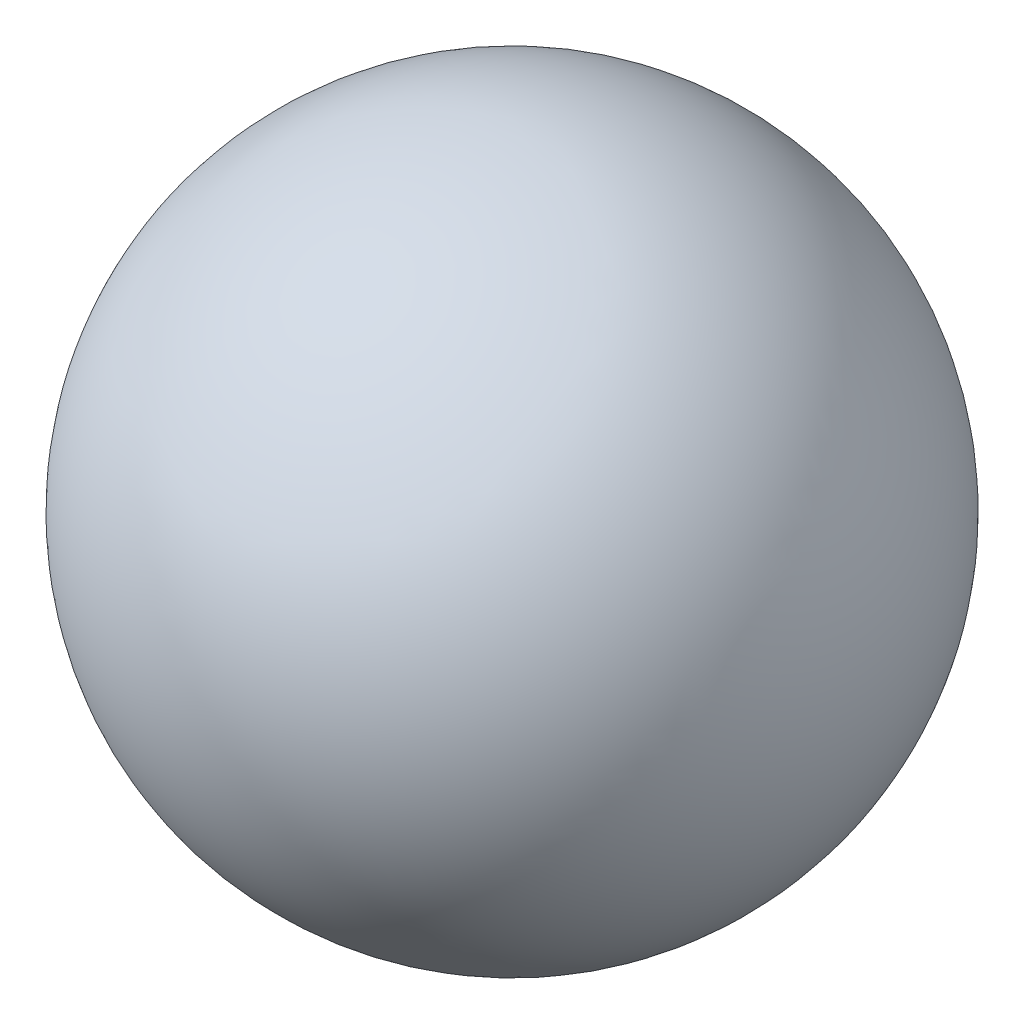
ISO-10303-21;
HEADER;
FILE_DESCRIPTION(('STEP AP214'),'2;1');
FILE_NAME('part.step','',(''),(''),'','','');
FILE_SCHEMA(('AUTOMOTIVE_DESIGN { 1 0 10303 214 1 1 1 1 }'));
ENDSEC;
DATA;
#1=APPLICATION_CONTEXT('core data for automotive mechanical design processes');
#2=APPLICATION_PROTOCOL_DEFINITION('international standard','automotive_design',2000,#1);
#3=PRODUCT_CONTEXT('',#1,'mechanical');
#4=PRODUCT('Part','Part','',(#3));
#5=PRODUCT_RELATED_PRODUCT_CATEGORY('part','',(#4));
#6=PRODUCT_DEFINITION_FORMATION('','',#4);
#7=PRODUCT_DEFINITION_CONTEXT('part definition',#1,'design');
#8=PRODUCT_DEFINITION('design','',#6,#7);
#9=PRODUCT_DEFINITION_SHAPE('','',#8);
#10=(LENGTH_UNIT() NAMED_UNIT(*) SI_UNIT(.MILLI.,.METRE.));
#11=(NAMED_UNIT(*) PLANE_ANGLE_UNIT() SI_UNIT($,.RADIAN.));
#12=(NAMED_UNIT(*) SI_UNIT($,.STERADIAN.) SOLID_ANGLE_UNIT());
#13=UNCERTAINTY_MEASURE_WITH_UNIT(LENGTH_MEASURE(1.E-05),#10,'distance_accuracy_value','');
#14=(GEOMETRIC_REPRESENTATION_CONTEXT(3) GLOBAL_UNCERTAINTY_ASSIGNED_CONTEXT((#13)) GLOBAL_UNIT_ASSIGNED_CONTEXT((#10,
#11,#12)) REPRESENTATION_CONTEXT('',''));
#15=CARTESIAN_POINT('',(0.,0.,0.));
#16=DIRECTION('',(0.,0.,1.));
#17=DIRECTION('',(1.,0.,0.));
#18=AXIS2_PLACEMENT_3D('',#15,#16,#17);
#19=CARTESIAN_POINT('',(10.5,9.239,3.827));
#20=DIRECTION('',(1.,0.,0.));
#21=DIRECTION('',(0.,-1.,0.));
#22=AXIS2_PLACEMENT_3D('',#19,#20,#21);
#23=SPHERICAL_SURFACE('',#22,2.382);
#24=CARTESIAN_POINT('',(12.882,9.239,3.827));
#25=VERTEX_POINT('',#24);
#26=VERTEX_LOOP('',#25);
#27=FACE_BOUND('',#26,.T.);
#28=ADVANCED_FACE('F27',(#27),#23,.T.);
#29=CLOSED_SHELL('',(#28));
#30=MANIFOLD_SOLID_BREP('B2',#29);
#31=ADVANCED_BREP_SHAPE_REPRESENTATION('',(#18,#30),#14);
#32=SHAPE_DEFINITION_REPRESENTATION(#9,#31);
ENDSEC;
END-ISO-10303-21;
